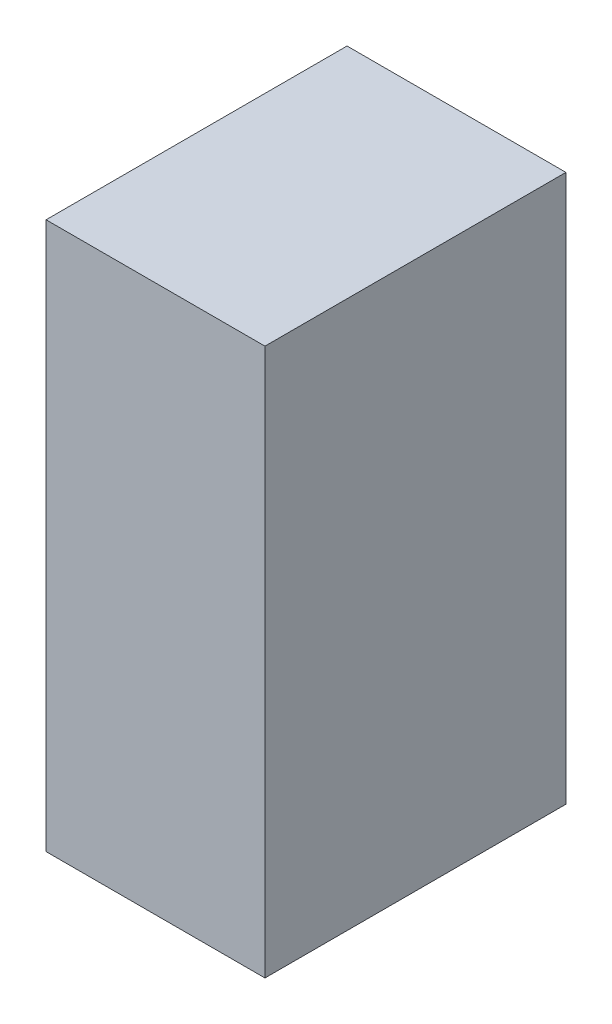
ISO-10303-21;
HEADER;
FILE_DESCRIPTION(('STEP AP214'),'2;1');
FILE_NAME('part.step','',(''),(''),'','','');
FILE_SCHEMA(('AUTOMOTIVE_DESIGN { 1 0 10303 214 1 1 1 1 }'));
ENDSEC;
DATA;
#1=APPLICATION_CONTEXT('core data for automotive mechanical design processes');
#2=APPLICATION_PROTOCOL_DEFINITION('international standard','automotive_design',2000,#1);
#3=PRODUCT_CONTEXT('',#1,'mechanical');
#4=PRODUCT('Part','Part','',(#3));
#5=PRODUCT_RELATED_PRODUCT_CATEGORY('part','',(#4));
#6=PRODUCT_DEFINITION_FORMATION('','',#4);
#7=PRODUCT_DEFINITION_CONTEXT('part definition',#1,'design');
#8=PRODUCT_DEFINITION('design','',#6,#7);
#9=PRODUCT_DEFINITION_SHAPE('','',#8);
#10=(LENGTH_UNIT() NAMED_UNIT(*) SI_UNIT(.MILLI.,.METRE.));
#11=(NAMED_UNIT(*) PLANE_ANGLE_UNIT() SI_UNIT($,.RADIAN.));
#12=(NAMED_UNIT(*) SI_UNIT($,.STERADIAN.) SOLID_ANGLE_UNIT());
#13=UNCERTAINTY_MEASURE_WITH_UNIT(LENGTH_MEASURE(1.E-05),#10,'distance_accuracy_value','');
#14=(GEOMETRIC_REPRESENTATION_CONTEXT(3) GLOBAL_UNCERTAINTY_ASSIGNED_CONTEXT((#13)) GLOBAL_UNIT_ASSIGNED_CONTEXT((#10,
#11,#12)) REPRESENTATION_CONTEXT('',''));
#15=CARTESIAN_POINT('',(0.,0.,0.));
#16=DIRECTION('',(0.,0.,1.));
#17=DIRECTION('',(1.,0.,0.));
#18=AXIS2_PLACEMENT_3D('',#15,#16,#17);
#19=CARTESIAN_POINT('',(0.80000094,-2.00000108,0.));
#20=DIRECTION('',(-1.,0.,0.));
#21=DIRECTION('',(0.,0.,1.));
#22=AXIS2_PLACEMENT_3D('',#19,#20,#21);
#23=PLANE('',#22);
#24=DIRECTION('',(0.,0.,-1.));
#25=VECTOR('',#24,1.);
#26=CARTESIAN_POINT('',(0.80000094,2.00000108,0.));
#27=LINE('',#26,#25);
#28=CARTESIAN_POINT('',(0.80000094,2.00000108,0.));
#29=VERTEX_POINT('',#28);
#30=CARTESIAN_POINT('',(0.80000094,2.00000108,2.20000068));
#31=VERTEX_POINT('',#30);
#32=EDGE_CURVE('E20',#29,#31,#27,.F.);
#33=ORIENTED_EDGE('',*,*,#32,.T.);
#34=DIRECTION('',(0.,1.,0.));
#35=VECTOR('',#34,1.);
#36=CARTESIAN_POINT('',(0.80000094,2.00000108,2.20000068));
#37=LINE('',#36,#35);
#38=CARTESIAN_POINT('',(0.80000094,-2.00000108,2.20000068));
#39=VERTEX_POINT('',#38);
#40=EDGE_CURVE('E55',#31,#39,#37,.F.);
#41=ORIENTED_EDGE('',*,*,#40,.T.);
#42=DIRECTION('',(0.,0.,1.));
#43=VECTOR('',#42,1.);
#44=CARTESIAN_POINT('',(0.80000094,-2.00000108,0.));
#45=LINE('',#44,#43);
#46=CARTESIAN_POINT('',(0.80000094,-2.00000108,0.));
#47=VERTEX_POINT('',#46);
#48=EDGE_CURVE('E74',#39,#47,#45,.F.);
#49=ORIENTED_EDGE('',*,*,#48,.T.);
#50=DIRECTION('',(0.,1.,0.));
#51=VECTOR('',#50,1.);
#52=CARTESIAN_POINT('',(0.80000094,2.00000108,0.));
#53=LINE('',#52,#51);
#54=EDGE_CURVE('E66',#29,#47,#53,.F.);
#55=ORIENTED_EDGE('',*,*,#54,.F.);
#56=EDGE_LOOP('',(#33,#41,#49,#55));
#57=FACE_BOUND('',#56,.T.);
#58=ADVANCED_FACE('F17',(#57),#23,.F.);
#59=CARTESIAN_POINT('',(0.80000094,2.00000108,0.));
#60=DIRECTION('',(0.,-1.,0.));
#61=DIRECTION('',(0.,0.,-1.));
#62=AXIS2_PLACEMENT_3D('',#59,#60,#61);
#63=PLANE('',#62);
#64=DIRECTION('',(0.,0.,-1.));
#65=VECTOR('',#64,1.);
#66=CARTESIAN_POINT('',(-0.80000094,2.00000108,0.));
#67=LINE('',#66,#65);
#68=CARTESIAN_POINT('',(-0.80000094,2.00000108,0.));
#69=VERTEX_POINT('',#68);
#70=CARTESIAN_POINT('',(-0.80000094,2.00000108,2.20000068));
#71=VERTEX_POINT('',#70);
#72=EDGE_CURVE('E72',#69,#71,#67,.F.);
#73=ORIENTED_EDGE('',*,*,#72,.T.);
#74=DIRECTION('',(-1.,0.,0.));
#75=VECTOR('',#74,1.);
#76=CARTESIAN_POINT('',(0.80000094,2.00000108,2.20000068));
#77=LINE('',#76,#75);
#78=EDGE_CURVE('E62',#71,#31,#77,.F.);
#79=ORIENTED_EDGE('',*,*,#78,.T.);
#80=ORIENTED_EDGE('',*,*,#32,.F.);
#81=DIRECTION('',(-1.,0.,0.));
#82=VECTOR('',#81,1.);
#83=CARTESIAN_POINT('',(0.80000094,2.00000108,0.));
#84=LINE('',#83,#82);
#85=EDGE_CURVE('E80',#69,#29,#84,.F.);
#86=ORIENTED_EDGE('',*,*,#85,.F.);
#87=EDGE_LOOP('',(#73,#79,#80,#86));
#88=FACE_BOUND('',#87,.T.);
#89=ADVANCED_FACE('F71',(#88),#63,.F.);
#90=CARTESIAN_POINT('',(0.80000094,2.00000108,2.20000068));
#91=DIRECTION('',(0.,0.,-1.));
#92=DIRECTION('',(-1.,0.,0.));
#93=AXIS2_PLACEMENT_3D('',#90,#91,#92);
#94=PLANE('',#93);
#95=DIRECTION('',(0.,1.,0.));
#96=VECTOR('',#95,1.);
#97=CARTESIAN_POINT('',(-0.80000094,2.00000108,2.20000068));
#98=LINE('',#97,#96);
#99=CARTESIAN_POINT('',(-0.80000094,-2.00000108,2.20000068));
#100=VERTEX_POINT('',#99);
#101=EDGE_CURVE('E83',#71,#100,#98,.F.);
#102=ORIENTED_EDGE('',*,*,#101,.T.);
#103=DIRECTION('',(1.,0.,0.));
#104=VECTOR('',#103,1.);
#105=CARTESIAN_POINT('',(-0.80000094,-2.00000108,2.20000068));
#106=LINE('',#105,#104);
#107=EDGE_CURVE('E64',#100,#39,#106,.T.);
#108=ORIENTED_EDGE('',*,*,#107,.T.);
#109=ORIENTED_EDGE('',*,*,#40,.F.);
#110=ORIENTED_EDGE('',*,*,#78,.F.);
#111=EDGE_LOOP('',(#102,#108,#109,#110));
#112=FACE_BOUND('',#111,.T.);
#113=ADVANCED_FACE('F60',(#112),#94,.F.);
#114=CARTESIAN_POINT('',(-0.80000094,-2.00000108,0.));
#115=DIRECTION('',(0.,1.,0.));
#116=DIRECTION('',(0.,0.,1.));
#117=AXIS2_PLACEMENT_3D('',#114,#115,#116);
#118=PLANE('',#117);
#119=ORIENTED_EDGE('',*,*,#48,.F.);
#120=ORIENTED_EDGE('',*,*,#107,.F.);
#121=DIRECTION('',(0.,0.,-1.));
#122=VECTOR('',#121,1.);
#123=CARTESIAN_POINT('',(-0.80000094,-2.00000108,0.));
#124=LINE('',#123,#122);
#125=CARTESIAN_POINT('',(-0.80000094,-2.00000108,0.));
#126=VERTEX_POINT('',#125);
#127=EDGE_CURVE('E26',#100,#126,#124,.T.);
#128=ORIENTED_EDGE('',*,*,#127,.T.);
#129=DIRECTION('',(-1.,0.,0.));
#130=VECTOR('',#129,1.);
#131=CARTESIAN_POINT('',(0.80000094,-2.00000108,0.));
#132=LINE('',#131,#130);
#133=EDGE_CURVE('E34',#47,#126,#132,.T.);
#134=ORIENTED_EDGE('',*,*,#133,.F.);
#135=EDGE_LOOP('',(#119,#120,#128,#134));
#136=FACE_BOUND('',#135,.T.);
#137=ADVANCED_FACE('F88',(#136),#118,.F.);
#138=CARTESIAN_POINT('',(0.80000094,2.00000108,0.));
#139=DIRECTION('',(0.,0.,-1.));
#140=DIRECTION('',(-1.,0.,0.));
#141=AXIS2_PLACEMENT_3D('',#138,#139,#140);
#142=PLANE('',#141);
#143=DIRECTION('',(0.,1.,0.));
#144=VECTOR('',#143,1.);
#145=CARTESIAN_POINT('',(-0.80000094,2.00000108,0.));
#146=LINE('',#145,#144);
#147=EDGE_CURVE('E11',#126,#69,#146,.T.);
#148=ORIENTED_EDGE('',*,*,#147,.T.);
#149=ORIENTED_EDGE('',*,*,#85,.T.);
#150=ORIENTED_EDGE('',*,*,#54,.T.);
#151=ORIENTED_EDGE('',*,*,#133,.T.);
#152=EDGE_LOOP('',(#148,#149,#150,#151));
#153=FACE_BOUND('',#152,.T.);
#154=ADVANCED_FACE('F91',(#153),#142,.T.);
#155=CARTESIAN_POINT('',(-0.80000094,2.00000108,0.));
#156=DIRECTION('',(1.,0.,0.));
#157=DIRECTION('',(0.,0.,-1.));
#158=AXIS2_PLACEMENT_3D('',#155,#156,#157);
#159=PLANE('',#158);
#160=ORIENTED_EDGE('',*,*,#127,.F.);
#161=ORIENTED_EDGE('',*,*,#101,.F.);
#162=ORIENTED_EDGE('',*,*,#72,.F.);
#163=ORIENTED_EDGE('',*,*,#147,.F.);
#164=EDGE_LOOP('',(#160,#161,#162,#163));
#165=FACE_BOUND('',#164,.T.);
#166=ADVANCED_FACE('F90',(#165),#159,.F.);
#167=CLOSED_SHELL('',(#58,#89,#113,#137,#154,#166));
#168=MANIFOLD_SOLID_BREP('B1',#167);
#169=ADVANCED_BREP_SHAPE_REPRESENTATION('',(#18,#168),#14);
#170=SHAPE_DEFINITION_REPRESENTATION(#9,#169);
ENDSEC;
END-ISO-10303-21;
